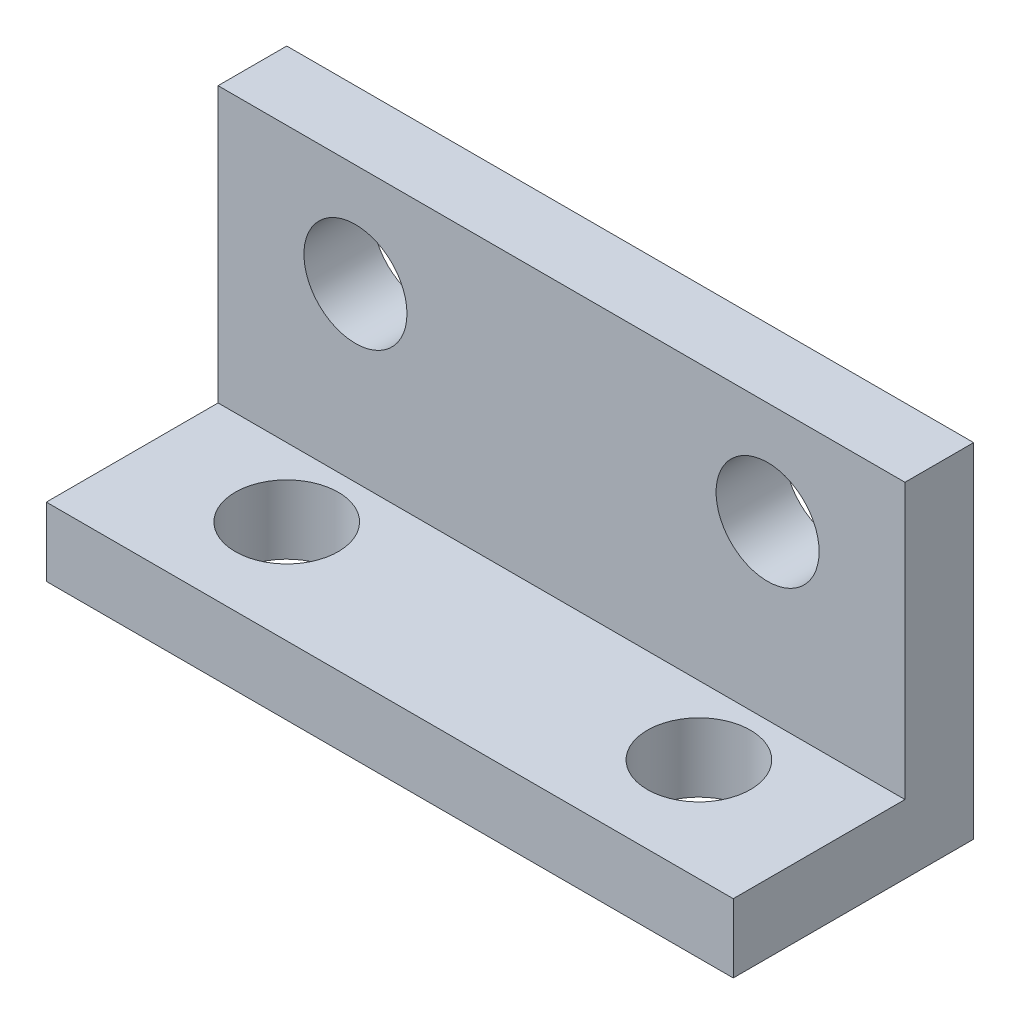
ISO-10303-21;
HEADER;
FILE_DESCRIPTION(('STEP AP214'),'2;1');
FILE_NAME('part.step','',(''),(''),'','','');
FILE_SCHEMA(('AUTOMOTIVE_DESIGN { 1 0 10303 214 1 1 1 1 }'));
ENDSEC;
DATA;
#1=APPLICATION_CONTEXT('core data for automotive mechanical design processes');
#2=APPLICATION_PROTOCOL_DEFINITION('international standard','automotive_design',2000,#1);
#3=PRODUCT_CONTEXT('',#1,'mechanical');
#4=PRODUCT('Part','Part','',(#3));
#5=PRODUCT_RELATED_PRODUCT_CATEGORY('part','',(#4));
#6=PRODUCT_DEFINITION_FORMATION('','',#4);
#7=PRODUCT_DEFINITION_CONTEXT('part definition',#1,'design');
#8=PRODUCT_DEFINITION('design','',#6,#7);
#9=PRODUCT_DEFINITION_SHAPE('','',#8);
#10=(LENGTH_UNIT() NAMED_UNIT(*) SI_UNIT(.MILLI.,.METRE.));
#11=(NAMED_UNIT(*) PLANE_ANGLE_UNIT() SI_UNIT($,.RADIAN.));
#12=(NAMED_UNIT(*) SI_UNIT($,.STERADIAN.) SOLID_ANGLE_UNIT());
#13=UNCERTAINTY_MEASURE_WITH_UNIT(LENGTH_MEASURE(1.E-05),#10,'distance_accuracy_value','');
#14=(GEOMETRIC_REPRESENTATION_CONTEXT(3) GLOBAL_UNCERTAINTY_ASSIGNED_CONTEXT((#13)) GLOBAL_UNIT_ASSIGNED_CONTEXT((#10,
#11,#12)) REPRESENTATION_CONTEXT('',''));
#15=CARTESIAN_POINT('',(0.,0.,0.));
#16=DIRECTION('',(0.,0.,1.));
#17=DIRECTION('',(1.,0.,0.));
#18=AXIS2_PLACEMENT_3D('',#15,#16,#17);
#19=CARTESIAN_POINT('',(20.,0.,0.));
#20=DIRECTION('',(0.,1.,0.));
#21=DIRECTION('',(0.,0.,1.));
#22=AXIS2_PLACEMENT_3D('',#19,#20,#21);
#23=PLANE('',#22);
#24=CARTESIAN_POINT('',(4.,0.,4.));
#25=DIRECTION('',(0.,1.,0.));
#26=DIRECTION('',(0.,0.,1.));
#27=AXIS2_PLACEMENT_3D('',#24,#25,#26);
#28=CIRCLE('',#27,1.5);
#29=CARTESIAN_POINT('',(4.,0.,5.5));
#30=VERTEX_POINT('',#29);
#31=EDGE_CURVE('E125',#30,#30,#28,.T.);
#32=ORIENTED_EDGE('',*,*,#31,.T.);
#33=EDGE_LOOP('',(#32));
#34=FACE_BOUND('',#33,.T.);
#35=CARTESIAN_POINT('',(16.,0.,4.));
#36=DIRECTION('',(0.,1.,0.));
#37=DIRECTION('',(0.,0.,1.));
#38=AXIS2_PLACEMENT_3D('',#35,#36,#37);
#39=CIRCLE('',#38,1.5);
#40=CARTESIAN_POINT('',(16.,0.,5.5));
#41=VERTEX_POINT('',#40);
#42=EDGE_CURVE('E168',#41,#41,#39,.T.);
#43=ORIENTED_EDGE('',*,*,#42,.T.);
#44=EDGE_LOOP('',(#43));
#45=FACE_BOUND('',#44,.T.);
#46=DIRECTION('',(0.,0.,-1.));
#47=VECTOR('',#46,1.);
#48=CARTESIAN_POINT('',(0.,0.,0.));
#49=LINE('',#48,#47);
#50=CARTESIAN_POINT('',(0.,0.,7.));
#51=VERTEX_POINT('',#50);
#52=CARTESIAN_POINT('',(0.,0.,0.));
#53=VERTEX_POINT('',#52);
#54=EDGE_CURVE('E121',#51,#53,#49,.T.);
#55=ORIENTED_EDGE('',*,*,#54,.T.);
#56=DIRECTION('',(-1.,0.,0.));
#57=VECTOR('',#56,1.);
#58=CARTESIAN_POINT('',(20.,0.,0.));
#59=LINE('',#58,#57);
#60=CARTESIAN_POINT('',(20.,0.,0.));
#61=VERTEX_POINT('',#60);
#62=EDGE_CURVE('E11',#61,#53,#59,.T.);
#63=ORIENTED_EDGE('',*,*,#62,.F.);
#64=DIRECTION('',(0.,0.,-1.));
#65=VECTOR('',#64,1.);
#66=CARTESIAN_POINT('',(20.,0.,0.));
#67=LINE('',#66,#65);
#68=CARTESIAN_POINT('',(20.,0.,7.));
#69=VERTEX_POINT('',#68);
#70=EDGE_CURVE('E132',#69,#61,#67,.T.);
#71=ORIENTED_EDGE('',*,*,#70,.F.);
#72=DIRECTION('',(-1.,0.,0.));
#73=VECTOR('',#72,1.);
#74=CARTESIAN_POINT('',(20.,0.,7.));
#75=LINE('',#74,#73);
#76=EDGE_CURVE('E117',#69,#51,#75,.T.);
#77=ORIENTED_EDGE('',*,*,#76,.T.);
#78=EDGE_LOOP('',(#55,#63,#71,#77));
#79=FACE_BOUND('',#78,.T.);
#80=ADVANCED_FACE('F37',(#34,#45,#79),#23,.F.);
#81=CARTESIAN_POINT('',(20.,0.,0.));
#82=DIRECTION('',(0.,0.,1.));
#83=DIRECTION('',(1.,0.,0.));
#84=AXIS2_PLACEMENT_3D('',#81,#82,#83);
#85=PLANE('',#84);
#86=CARTESIAN_POINT('',(4.,7.,0.));
#87=DIRECTION('',(0.,0.,1.));
#88=DIRECTION('',(1.,0.,0.));
#89=AXIS2_PLACEMENT_3D('',#86,#87,#88);
#90=CIRCLE('',#89,1.5);
#91=CARTESIAN_POINT('',(5.5,7.,0.));
#92=VERTEX_POINT('',#91);
#93=EDGE_CURVE('E176',#92,#92,#90,.T.);
#94=ORIENTED_EDGE('',*,*,#93,.T.);
#95=EDGE_LOOP('',(#94));
#96=FACE_BOUND('',#95,.T.);
#97=CARTESIAN_POINT('',(16.,7.,0.));
#98=DIRECTION('',(0.,0.,1.));
#99=DIRECTION('',(1.,0.,0.));
#100=AXIS2_PLACEMENT_3D('',#97,#98,#99);
#101=CIRCLE('',#100,1.5);
#102=CARTESIAN_POINT('',(17.5,7.,0.));
#103=VERTEX_POINT('',#102);
#104=EDGE_CURVE('E185',#103,#103,#101,.T.);
#105=ORIENTED_EDGE('',*,*,#104,.T.);
#106=EDGE_LOOP('',(#105));
#107=FACE_BOUND('',#106,.T.);
#108=DIRECTION('',(0.,1.,0.));
#109=VECTOR('',#108,1.);
#110=CARTESIAN_POINT('',(0.,0.,0.));
#111=LINE('',#110,#109);
#112=CARTESIAN_POINT('',(0.,10.,0.));
#113=VERTEX_POINT('',#112);
#114=EDGE_CURVE('E124',#53,#113,#111,.T.);
#115=ORIENTED_EDGE('',*,*,#114,.T.);
#116=DIRECTION('',(-1.,0.,0.));
#117=VECTOR('',#116,1.);
#118=CARTESIAN_POINT('',(20.,10.,0.));
#119=LINE('',#118,#117);
#120=CARTESIAN_POINT('',(20.,10.,0.));
#121=VERTEX_POINT('',#120);
#122=EDGE_CURVE('E45',#121,#113,#119,.T.);
#123=ORIENTED_EDGE('',*,*,#122,.F.);
#124=DIRECTION('',(0.,1.,0.));
#125=VECTOR('',#124,1.);
#126=CARTESIAN_POINT('',(20.,0.,0.));
#127=LINE('',#126,#125);
#128=EDGE_CURVE('E90',#61,#121,#127,.T.);
#129=ORIENTED_EDGE('',*,*,#128,.F.);
#130=ORIENTED_EDGE('',*,*,#62,.T.);
#131=EDGE_LOOP('',(#115,#123,#129,#130));
#132=FACE_BOUND('',#131,.T.);
#133=ADVANCED_FACE('F157',(#96,#107,#132),#85,.F.);
#134=CARTESIAN_POINT('',(20.,10.,0.));
#135=DIRECTION('',(0.,-1.,0.));
#136=DIRECTION('',(0.,0.,-1.));
#137=AXIS2_PLACEMENT_3D('',#134,#135,#136);
#138=PLANE('',#137);
#139=DIRECTION('',(0.,0.,1.));
#140=VECTOR('',#139,1.);
#141=CARTESIAN_POINT('',(0.,10.,0.));
#142=LINE('',#141,#140);
#143=CARTESIAN_POINT('',(0.,10.,2.));
#144=VERTEX_POINT('',#143);
#145=EDGE_CURVE('E127',#113,#144,#142,.T.);
#146=ORIENTED_EDGE('',*,*,#145,.T.);
#147=DIRECTION('',(-1.,0.,0.));
#148=VECTOR('',#147,1.);
#149=CARTESIAN_POINT('',(20.,10.,2.));
#150=LINE('',#149,#148);
#151=CARTESIAN_POINT('',(20.,10.,2.));
#152=VERTEX_POINT('',#151);
#153=EDGE_CURVE('E112',#152,#144,#150,.T.);
#154=ORIENTED_EDGE('',*,*,#153,.F.);
#155=DIRECTION('',(0.,0.,1.));
#156=VECTOR('',#155,1.);
#157=CARTESIAN_POINT('',(20.,10.,0.));
#158=LINE('',#157,#156);
#159=EDGE_CURVE('E103',#121,#152,#158,.T.);
#160=ORIENTED_EDGE('',*,*,#159,.F.);
#161=ORIENTED_EDGE('',*,*,#122,.T.);
#162=EDGE_LOOP('',(#146,#154,#160,#161));
#163=FACE_BOUND('',#162,.T.);
#164=ADVANCED_FACE('F138',(#163),#138,.F.);
#165=CARTESIAN_POINT('',(20.,2.,2.));
#166=DIRECTION('',(0.,0.,-1.));
#167=DIRECTION('',(-1.,0.,0.));
#168=AXIS2_PLACEMENT_3D('',#165,#166,#167);
#169=PLANE('',#168);
#170=CARTESIAN_POINT('',(4.,7.,2.));
#171=DIRECTION('',(0.,0.,1.));
#172=DIRECTION('',(1.,0.,0.));
#173=AXIS2_PLACEMENT_3D('',#170,#171,#172);
#174=CIRCLE('',#173,1.5);
#175=CARTESIAN_POINT('',(5.5,7.,2.));
#176=VERTEX_POINT('',#175);
#177=EDGE_CURVE('E188',#176,#176,#174,.T.);
#178=ORIENTED_EDGE('',*,*,#177,.F.);
#179=EDGE_LOOP('',(#178));
#180=FACE_BOUND('',#179,.T.);
#181=CARTESIAN_POINT('',(16.,7.,2.));
#182=DIRECTION('',(0.,0.,1.));
#183=DIRECTION('',(1.,0.,0.));
#184=AXIS2_PLACEMENT_3D('',#181,#182,#183);
#185=CIRCLE('',#184,1.5);
#186=CARTESIAN_POINT('',(17.5,7.,2.));
#187=VERTEX_POINT('',#186);
#188=EDGE_CURVE('E182',#187,#187,#185,.T.);
#189=ORIENTED_EDGE('',*,*,#188,.F.);
#190=EDGE_LOOP('',(#189));
#191=FACE_BOUND('',#190,.T.);
#192=DIRECTION('',(0.,-1.,0.));
#193=VECTOR('',#192,1.);
#194=CARTESIAN_POINT('',(0.,2.,2.));
#195=LINE('',#194,#193);
#196=CARTESIAN_POINT('',(0.,2.,2.));
#197=VERTEX_POINT('',#196);
#198=EDGE_CURVE('E111',#144,#197,#195,.T.);
#199=ORIENTED_EDGE('',*,*,#198,.T.);
#200=DIRECTION('',(-1.,0.,0.));
#201=VECTOR('',#200,1.);
#202=CARTESIAN_POINT('',(20.,2.,2.));
#203=LINE('',#202,#201);
#204=CARTESIAN_POINT('',(20.,2.,2.));
#205=VERTEX_POINT('',#204);
#206=EDGE_CURVE('E108',#205,#197,#203,.T.);
#207=ORIENTED_EDGE('',*,*,#206,.F.);
#208=DIRECTION('',(0.,-1.,0.));
#209=VECTOR('',#208,1.);
#210=CARTESIAN_POINT('',(20.,2.,2.));
#211=LINE('',#210,#209);
#212=EDGE_CURVE('E97',#152,#205,#211,.T.);
#213=ORIENTED_EDGE('',*,*,#212,.F.);
#214=ORIENTED_EDGE('',*,*,#153,.T.);
#215=EDGE_LOOP('',(#199,#207,#213,#214));
#216=FACE_BOUND('',#215,.T.);
#217=ADVANCED_FACE('F109',(#180,#191,#216),#169,.F.);
#218=CARTESIAN_POINT('',(20.,2.,2.));
#219=DIRECTION('',(0.,-1.,0.));
#220=DIRECTION('',(0.,0.,-1.));
#221=AXIS2_PLACEMENT_3D('',#218,#219,#220);
#222=PLANE('',#221);
#223=CARTESIAN_POINT('',(4.,2.,4.));
#224=DIRECTION('',(0.,1.,0.));
#225=DIRECTION('',(0.,0.,1.));
#226=AXIS2_PLACEMENT_3D('',#223,#224,#225);
#227=CIRCLE('',#226,1.5);
#228=CARTESIAN_POINT('',(4.,2.,5.5));
#229=VERTEX_POINT('',#228);
#230=EDGE_CURVE('E170',#229,#229,#227,.T.);
#231=ORIENTED_EDGE('',*,*,#230,.F.);
#232=EDGE_LOOP('',(#231));
#233=FACE_BOUND('',#232,.T.);
#234=CARTESIAN_POINT('',(16.,2.,4.));
#235=DIRECTION('',(0.,1.,0.));
#236=DIRECTION('',(0.,0.,1.));
#237=AXIS2_PLACEMENT_3D('',#234,#235,#236);
#238=CIRCLE('',#237,1.5);
#239=CARTESIAN_POINT('',(16.,2.,5.5));
#240=VERTEX_POINT('',#239);
#241=EDGE_CURVE('E171',#240,#240,#238,.T.);
#242=ORIENTED_EDGE('',*,*,#241,.F.);
#243=EDGE_LOOP('',(#242));
#244=FACE_BOUND('',#243,.T.);
#245=DIRECTION('',(0.,0.,1.));
#246=VECTOR('',#245,1.);
#247=CARTESIAN_POINT('',(0.,2.,2.));
#248=LINE('',#247,#246);
#249=CARTESIAN_POINT('',(0.,2.,7.));
#250=VERTEX_POINT('',#249);
#251=EDGE_CURVE('E76',#197,#250,#248,.T.);
#252=ORIENTED_EDGE('',*,*,#251,.T.);
#253=DIRECTION('',(-1.,0.,0.));
#254=VECTOR('',#253,1.);
#255=CARTESIAN_POINT('',(20.,2.,7.));
#256=LINE('',#255,#254);
#257=CARTESIAN_POINT('',(20.,2.,7.));
#258=VERTEX_POINT('',#257);
#259=EDGE_CURVE('E113',#258,#250,#256,.T.);
#260=ORIENTED_EDGE('',*,*,#259,.F.);
#261=DIRECTION('',(0.,0.,1.));
#262=VECTOR('',#261,1.);
#263=CARTESIAN_POINT('',(20.,2.,2.));
#264=LINE('',#263,#262);
#265=EDGE_CURVE('E101',#205,#258,#264,.T.);
#266=ORIENTED_EDGE('',*,*,#265,.F.);
#267=ORIENTED_EDGE('',*,*,#206,.T.);
#268=EDGE_LOOP('',(#252,#260,#266,#267));
#269=FACE_BOUND('',#268,.T.);
#270=ADVANCED_FACE('F115',(#233,#244,#269),#222,.F.);
#271=CARTESIAN_POINT('',(20.,0.,7.));
#272=DIRECTION('',(0.,0.,-1.));
#273=DIRECTION('',(-1.,0.,0.));
#274=AXIS2_PLACEMENT_3D('',#271,#272,#273);
#275=PLANE('',#274);
#276=DIRECTION('',(0.,-1.,0.));
#277=VECTOR('',#276,1.);
#278=CARTESIAN_POINT('',(0.,0.,7.));
#279=LINE('',#278,#277);
#280=EDGE_CURVE('E82',#250,#51,#279,.T.);
#281=ORIENTED_EDGE('',*,*,#280,.T.);
#282=ORIENTED_EDGE('',*,*,#76,.F.);
#283=DIRECTION('',(0.,-1.,0.));
#284=VECTOR('',#283,1.);
#285=CARTESIAN_POINT('',(20.,0.,7.));
#286=LINE('',#285,#284);
#287=EDGE_CURVE('E53',#258,#69,#286,.T.);
#288=ORIENTED_EDGE('',*,*,#287,.F.);
#289=ORIENTED_EDGE('',*,*,#259,.T.);
#290=EDGE_LOOP('',(#281,#282,#288,#289));
#291=FACE_BOUND('',#290,.T.);
#292=ADVANCED_FACE('F145',(#291),#275,.F.);
#293=CARTESIAN_POINT('',(20.,0.,0.));
#294=DIRECTION('',(-1.,0.,0.));
#295=DIRECTION('',(0.,0.,1.));
#296=AXIS2_PLACEMENT_3D('',#293,#294,#295);
#297=PLANE('',#296);
#298=ORIENTED_EDGE('',*,*,#70,.T.);
#299=ORIENTED_EDGE('',*,*,#128,.T.);
#300=ORIENTED_EDGE('',*,*,#159,.T.);
#301=ORIENTED_EDGE('',*,*,#212,.T.);
#302=ORIENTED_EDGE('',*,*,#265,.T.);
#303=ORIENTED_EDGE('',*,*,#287,.T.);
#304=EDGE_LOOP('',(#298,#299,#300,#301,#302,#303));
#305=FACE_BOUND('',#304,.T.);
#306=ADVANCED_FACE('F99',(#305),#297,.F.);
#307=CARTESIAN_POINT('',(0.,0.,0.));
#308=DIRECTION('',(-1.,0.,0.));
#309=DIRECTION('',(0.,0.,1.));
#310=AXIS2_PLACEMENT_3D('',#307,#308,#309);
#311=PLANE('',#310);
#312=ORIENTED_EDGE('',*,*,#54,.F.);
#313=ORIENTED_EDGE('',*,*,#280,.F.);
#314=ORIENTED_EDGE('',*,*,#251,.F.);
#315=ORIENTED_EDGE('',*,*,#198,.F.);
#316=ORIENTED_EDGE('',*,*,#145,.F.);
#317=ORIENTED_EDGE('',*,*,#114,.F.);
#318=EDGE_LOOP('',(#312,#313,#314,#315,#316,#317));
#319=FACE_BOUND('',#318,.T.);
#320=ADVANCED_FACE('F141',(#319),#311,.T.);
#321=CARTESIAN_POINT('',(16.,0.,4.));
#322=DIRECTION('',(0.,1.,0.));
#323=DIRECTION('',(0.,0.,1.));
#324=AXIS2_PLACEMENT_3D('',#321,#322,#323);
#325=CYLINDRICAL_SURFACE('',#324,1.5);
#326=ORIENTED_EDGE('',*,*,#42,.F.);
#327=EDGE_LOOP('',(#326));
#328=FACE_BOUND('',#327,.T.);
#329=ORIENTED_EDGE('',*,*,#241,.T.);
#330=EDGE_LOOP('',(#329));
#331=FACE_BOUND('',#330,.T.);
#332=ADVANCED_FACE('F214',(#328,#331),#325,.F.);
#333=CARTESIAN_POINT('',(4.,0.,4.));
#334=DIRECTION('',(0.,1.,0.));
#335=DIRECTION('',(0.,0.,1.));
#336=AXIS2_PLACEMENT_3D('',#333,#334,#335);
#337=CYLINDRICAL_SURFACE('',#336,1.5);
#338=ORIENTED_EDGE('',*,*,#31,.F.);
#339=EDGE_LOOP('',(#338));
#340=FACE_BOUND('',#339,.T.);
#341=ORIENTED_EDGE('',*,*,#230,.T.);
#342=EDGE_LOOP('',(#341));
#343=FACE_BOUND('',#342,.T.);
#344=ADVANCED_FACE('F208',(#340,#343),#337,.F.);
#345=CARTESIAN_POINT('',(16.,7.,0.));
#346=DIRECTION('',(0.,0.,1.));
#347=DIRECTION('',(1.,0.,0.));
#348=AXIS2_PLACEMENT_3D('',#345,#346,#347);
#349=CYLINDRICAL_SURFACE('',#348,1.5);
#350=ORIENTED_EDGE('',*,*,#104,.F.);
#351=EDGE_LOOP('',(#350));
#352=FACE_BOUND('',#351,.T.);
#353=ORIENTED_EDGE('',*,*,#188,.T.);
#354=EDGE_LOOP('',(#353));
#355=FACE_BOUND('',#354,.T.);
#356=ADVANCED_FACE('F198',(#352,#355),#349,.F.);
#357=CARTESIAN_POINT('',(4.,7.,0.));
#358=DIRECTION('',(0.,0.,1.));
#359=DIRECTION('',(1.,0.,0.));
#360=AXIS2_PLACEMENT_3D('',#357,#358,#359);
#361=CYLINDRICAL_SURFACE('',#360,1.5);
#362=ORIENTED_EDGE('',*,*,#93,.F.);
#363=EDGE_LOOP('',(#362));
#364=FACE_BOUND('',#363,.T.);
#365=ORIENTED_EDGE('',*,*,#177,.T.);
#366=EDGE_LOOP('',(#365));
#367=FACE_BOUND('',#366,.T.);
#368=ADVANCED_FACE('F195',(#364,#367),#361,.F.);
#369=CLOSED_SHELL('',(#80,#133,#164,#217,#270,#292,#306,#320,#332,#344,#356,#368));
#370=MANIFOLD_SOLID_BREP('B2',#369);
#371=ADVANCED_BREP_SHAPE_REPRESENTATION('',(#18,#370),#14);
#372=SHAPE_DEFINITION_REPRESENTATION(#9,#371);
ENDSEC;
END-ISO-10303-21;
